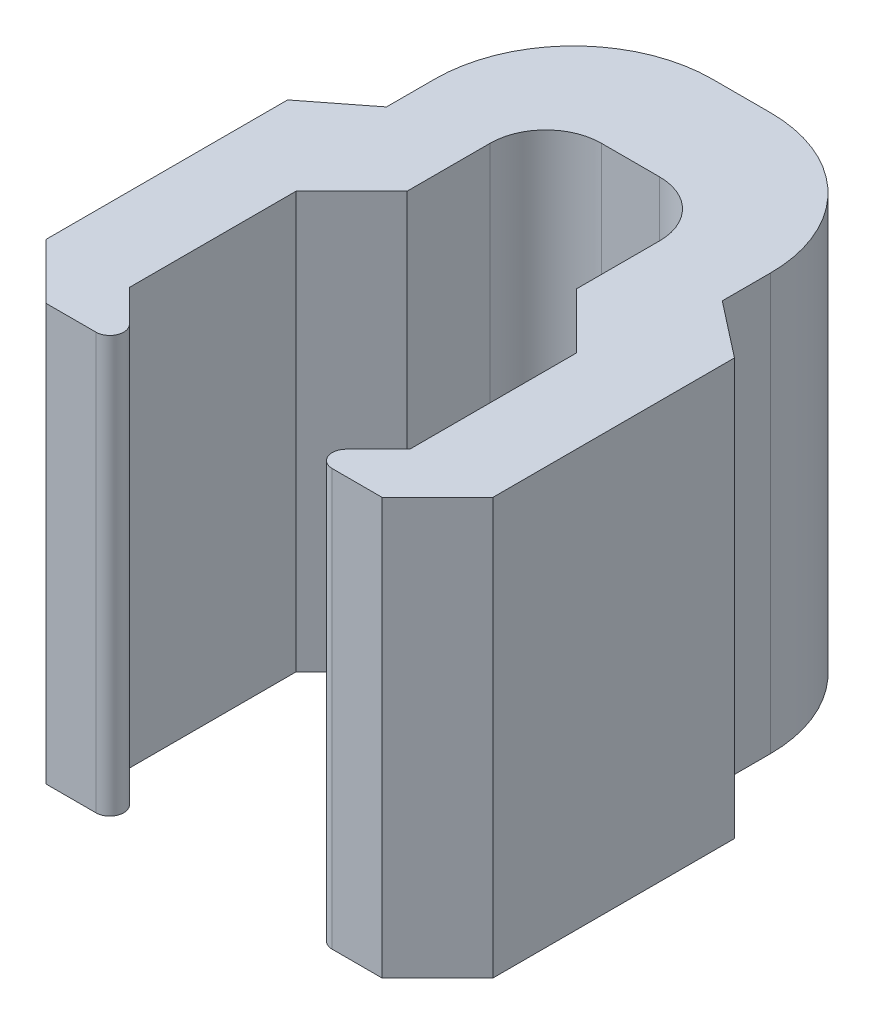
ISO-10303-21;
HEADER;
FILE_DESCRIPTION(('STEP AP214'),'2;1');
FILE_NAME('part.step','',(''),(''),'','','');
FILE_SCHEMA(('AUTOMOTIVE_DESIGN { 1 0 10303 214 1 1 1 1 }'));
ENDSEC;
DATA;
#1=APPLICATION_CONTEXT('core data for automotive mechanical design processes');
#2=APPLICATION_PROTOCOL_DEFINITION('international standard','automotive_design',2000,#1);
#3=PRODUCT_CONTEXT('',#1,'mechanical');
#4=PRODUCT('Part','Part','',(#3));
#5=PRODUCT_RELATED_PRODUCT_CATEGORY('part','',(#4));
#6=PRODUCT_DEFINITION_FORMATION('','',#4);
#7=PRODUCT_DEFINITION_CONTEXT('part definition',#1,'design');
#8=PRODUCT_DEFINITION('design','',#6,#7);
#9=PRODUCT_DEFINITION_SHAPE('','',#8);
#10=(LENGTH_UNIT() NAMED_UNIT(*) SI_UNIT(.MILLI.,.METRE.));
#11=(NAMED_UNIT(*) PLANE_ANGLE_UNIT() SI_UNIT($,.RADIAN.));
#12=(NAMED_UNIT(*) SI_UNIT($,.STERADIAN.) SOLID_ANGLE_UNIT());
#13=UNCERTAINTY_MEASURE_WITH_UNIT(LENGTH_MEASURE(1.E-05),#10,'distance_accuracy_value','');
#14=(GEOMETRIC_REPRESENTATION_CONTEXT(3) GLOBAL_UNCERTAINTY_ASSIGNED_CONTEXT((#13)) GLOBAL_UNIT_ASSIGNED_CONTEXT((#10,
#11,#12)) REPRESENTATION_CONTEXT('',''));
#15=CARTESIAN_POINT('',(0.,0.,0.));
#16=DIRECTION('',(0.,0.,1.));
#17=DIRECTION('',(1.,0.,0.));
#18=AXIS2_PLACEMENT_3D('',#15,#16,#17);
#19=CARTESIAN_POINT('',(-11.1661026887094,15.,0.));
#20=DIRECTION('',(1.,0.,0.));
#21=DIRECTION('',(0.,0.,-1.));
#22=AXIS2_PLACEMENT_3D('',#19,#20,#21);
#23=PLANE('',#22);
#24=DIRECTION('',(0.,0.,1.));
#25=VECTOR('',#24,1.);
#26=CARTESIAN_POINT('',(-11.1661026887094,0.,0.));
#27=LINE('',#26,#25);
#28=CARTESIAN_POINT('',(-11.1661026887094,0.,-7.37104122945223));
#29=VERTEX_POINT('',#28);
#30=CARTESIAN_POINT('',(-11.1661026887094,0.,-1.37104122945223));
#31=VERTEX_POINT('',#30);
#32=EDGE_CURVE('E212',#29,#31,#27,.T.);
#33=ORIENTED_EDGE('',*,*,#32,.F.);
#34=DIRECTION('',(0.,-1.,0.));
#35=VECTOR('',#34,1.);
#36=CARTESIAN_POINT('',(-11.1661026887094,15.,-7.37104122945223));
#37=LINE('',#36,#35);
#38=CARTESIAN_POINT('',(-11.1661026887094,15.,-7.37104122945223));
#39=VERTEX_POINT('',#38);
#40=EDGE_CURVE('E207',#39,#29,#37,.T.);
#41=ORIENTED_EDGE('',*,*,#40,.F.);
#42=DIRECTION('',(0.,0.,1.));
#43=VECTOR('',#42,1.);
#44=CARTESIAN_POINT('',(-11.1661026887094,15.,0.));
#45=LINE('',#44,#43);
#46=CARTESIAN_POINT('',(-11.1661026887094,15.,-1.37104122945223));
#47=VERTEX_POINT('',#46);
#48=EDGE_CURVE('E210',#39,#47,#45,.T.);
#49=ORIENTED_EDGE('',*,*,#48,.T.);
#50=DIRECTION('',(0.,-1.,0.));
#51=VECTOR('',#50,1.);
#52=CARTESIAN_POINT('',(-11.1661026887094,15.,-1.37104122945223));
#53=LINE('',#52,#51);
#54=EDGE_CURVE('E273',#47,#31,#53,.T.);
#55=ORIENTED_EDGE('',*,*,#54,.T.);
#56=EDGE_LOOP('',(#33,#41,#49,#55));
#57=FACE_BOUND('',#56,.T.);
#58=ADVANCED_FACE('F34',(#57),#23,.T.);
#59=CARTESIAN_POINT('',(-9.26857195908083,15.,-9.26857195908083));
#60=DIRECTION('',(-0.707106781186547,0.,-0.707106781186548));
#61=DIRECTION('',(-0.707106781186548,0.,0.707106781186547));
#62=AXIS2_PLACEMENT_3D('',#59,#60,#61);
#63=PLANE('',#62);
#64=DIRECTION('',(0.707106781186548,0.,-0.707106781186547));
#65=VECTOR('',#64,1.);
#66=CARTESIAN_POINT('',(-9.26857195908083,0.,-9.26857195908083));
#67=LINE('',#66,#65);
#68=CARTESIAN_POINT('',(-9.16610268870943,0.,-9.37104122945222));
#69=VERTEX_POINT('',#68);
#70=EDGE_CURVE('E275',#29,#69,#67,.T.);
#71=ORIENTED_EDGE('',*,*,#70,.T.);
#72=DIRECTION('',(0.,-1.,0.));
#73=VECTOR('',#72,1.);
#74=CARTESIAN_POINT('',(-9.16610268870943,15.,-9.37104122945222));
#75=LINE('',#74,#73);
#76=CARTESIAN_POINT('',(-9.16610268870943,15.,-9.37104122945222));
#77=VERTEX_POINT('',#76);
#78=EDGE_CURVE('E216',#77,#69,#75,.T.);
#79=ORIENTED_EDGE('',*,*,#78,.F.);
#80=DIRECTION('',(0.707106781186548,0.,-0.707106781186547));
#81=VECTOR('',#80,1.);
#82=CARTESIAN_POINT('',(-9.26857195908083,15.,-9.26857195908083));
#83=LINE('',#82,#81);
#84=EDGE_CURVE('E219',#39,#77,#83,.T.);
#85=ORIENTED_EDGE('',*,*,#84,.F.);
#86=ORIENTED_EDGE('',*,*,#40,.T.);
#87=EDGE_LOOP('',(#71,#79,#85,#86));
#88=FACE_BOUND('',#87,.T.);
#89=ADVANCED_FACE('F220',(#88),#63,.F.);
#90=CARTESIAN_POINT('',(-9.16610268870943,15.,0.));
#91=DIRECTION('',(-1.,0.,0.));
#92=DIRECTION('',(0.,0.,1.));
#93=AXIS2_PLACEMENT_3D('',#90,#91,#92);
#94=PLANE('',#93);
#95=DIRECTION('',(0.,0.,-1.));
#96=VECTOR('',#95,1.);
#97=CARTESIAN_POINT('',(-9.16610268870943,0.,0.));
#98=LINE('',#97,#96);
#99=CARTESIAN_POINT('',(-9.16610268870943,0.,-12.3710412294522));
#100=VERTEX_POINT('',#99);
#101=EDGE_CURVE('E277',#69,#100,#98,.T.);
#102=ORIENTED_EDGE('',*,*,#101,.T.);
#103=DIRECTION('',(0.,-1.,0.));
#104=VECTOR('',#103,1.);
#105=CARTESIAN_POINT('',(-9.16610268870943,15.,-12.3710412294522));
#106=LINE('',#105,#104);
#107=CARTESIAN_POINT('',(-9.16610268870943,15.,-12.3710412294522));
#108=VERTEX_POINT('',#107);
#109=EDGE_CURVE('E362',#100,#108,#106,.F.);
#110=ORIENTED_EDGE('',*,*,#109,.T.);
#111=DIRECTION('',(0.,0.,-1.));
#112=VECTOR('',#111,1.);
#113=CARTESIAN_POINT('',(-9.16610268870943,15.,0.));
#114=LINE('',#113,#112);
#115=EDGE_CURVE('E224',#77,#108,#114,.T.);
#116=ORIENTED_EDGE('',*,*,#115,.F.);
#117=ORIENTED_EDGE('',*,*,#78,.T.);
#118=EDGE_LOOP('',(#102,#110,#116,#117));
#119=FACE_BOUND('',#118,.T.);
#120=ADVANCED_FACE('F411',(#119),#94,.F.);
#121=CARTESIAN_POINT('',(0.,15.,-14.3710412294522));
#122=DIRECTION('',(0.,0.,-1.));
#123=DIRECTION('',(-1.,0.,0.));
#124=AXIS2_PLACEMENT_3D('',#121,#122,#123);
#125=PLANE('',#124);
#126=DIRECTION('',(1.,0.,0.));
#127=VECTOR('',#126,1.);
#128=CARTESIAN_POINT('',(0.,0.,-14.3710412294522));
#129=LINE('',#128,#127);
#130=CARTESIAN_POINT('',(-7.16610268870943,0.,-14.3710412294522));
#131=VERTEX_POINT('',#130);
#132=CARTESIAN_POINT('',(-5.06610268870944,0.,-14.3710412294522));
#133=VERTEX_POINT('',#132);
#134=EDGE_CURVE('E280',#131,#133,#129,.T.);
#135=ORIENTED_EDGE('',*,*,#134,.T.);
#136=DIRECTION('',(0.,-1.,0.));
#137=VECTOR('',#136,1.);
#138=CARTESIAN_POINT('',(-5.06610268870944,15.,-14.3710412294522));
#139=LINE('',#138,#137);
#140=CARTESIAN_POINT('',(-5.06610268870944,15.,-14.3710412294522));
#141=VERTEX_POINT('',#140);
#142=EDGE_CURVE('E360',#133,#141,#139,.F.);
#143=ORIENTED_EDGE('',*,*,#142,.T.);
#144=DIRECTION('',(1.,0.,0.));
#145=VECTOR('',#144,1.);
#146=CARTESIAN_POINT('',(0.,15.,-14.3710412294522));
#147=LINE('',#146,#145);
#148=CARTESIAN_POINT('',(-7.16610268870943,15.,-14.3710412294522));
#149=VERTEX_POINT('',#148);
#150=EDGE_CURVE('E236',#149,#141,#147,.T.);
#151=ORIENTED_EDGE('',*,*,#150,.F.);
#152=DIRECTION('',(0.,-1.,0.));
#153=VECTOR('',#152,1.);
#154=CARTESIAN_POINT('',(-7.16610268870943,0.,-14.3710412294522));
#155=LINE('',#154,#153);
#156=EDGE_CURVE('E357',#149,#131,#155,.T.);
#157=ORIENTED_EDGE('',*,*,#156,.T.);
#158=EDGE_LOOP('',(#135,#143,#151,#157));
#159=FACE_BOUND('',#158,.T.);
#160=ADVANCED_FACE('F420',(#159),#125,.F.);
#161=CARTESIAN_POINT('',(-3.06610268870944,15.,0.));
#162=DIRECTION('',(-1.,0.,0.));
#163=DIRECTION('',(0.,0.,1.));
#164=AXIS2_PLACEMENT_3D('',#161,#162,#163);
#165=PLANE('',#164);
#166=DIRECTION('',(0.,0.,-1.));
#167=VECTOR('',#166,1.);
#168=CARTESIAN_POINT('',(-3.06610268870944,15.,0.));
#169=LINE('',#168,#167);
#170=CARTESIAN_POINT('',(-3.06610268870944,15.,-9.37104122945222));
#171=VERTEX_POINT('',#170);
#172=CARTESIAN_POINT('',(-3.06610268870944,15.,-12.3710412294522));
#173=VERTEX_POINT('',#172);
#174=EDGE_CURVE('E239',#171,#173,#169,.T.);
#175=ORIENTED_EDGE('',*,*,#174,.T.);
#176=DIRECTION('',(0.,-1.,0.));
#177=VECTOR('',#176,1.);
#178=CARTESIAN_POINT('',(-3.06610268870944,15.,-12.3710412294522));
#179=LINE('',#178,#177);
#180=CARTESIAN_POINT('',(-3.06610268870944,0.,-12.3710412294522));
#181=VERTEX_POINT('',#180);
#182=EDGE_CURVE('E354',#173,#181,#179,.T.);
#183=ORIENTED_EDGE('',*,*,#182,.T.);
#184=DIRECTION('',(0.,0.,-1.));
#185=VECTOR('',#184,1.);
#186=CARTESIAN_POINT('',(-3.06610268870944,0.,0.));
#187=LINE('',#186,#185);
#188=CARTESIAN_POINT('',(-3.06610268870944,0.,-9.37104122945222));
#189=VERTEX_POINT('',#188);
#190=EDGE_CURVE('E283',#189,#181,#187,.T.);
#191=ORIENTED_EDGE('',*,*,#190,.F.);
#192=DIRECTION('',(0.,-1.,0.));
#193=VECTOR('',#192,1.);
#194=CARTESIAN_POINT('',(-3.06610268870944,15.,-9.37104122945222));
#195=LINE('',#194,#193);
#196=EDGE_CURVE('E333',#171,#189,#195,.T.);
#197=ORIENTED_EDGE('',*,*,#196,.F.);
#198=EDGE_LOOP('',(#175,#183,#191,#197));
#199=FACE_BOUND('',#198,.T.);
#200=ADVANCED_FACE('F429',(#199),#165,.T.);
#201=CARTESIAN_POINT('',(3.15246927037139,15.,-3.15246927037139));
#202=DIRECTION('',(0.707106781186547,0.,-0.707106781186547));
#203=DIRECTION('',(-0.707106781186548,0.,-0.707106781186548));
#204=AXIS2_PLACEMENT_3D('',#201,#202,#203);
#205=PLANE('',#204);
#206=DIRECTION('',(0.707106781186548,0.,0.707106781186548));
#207=VECTOR('',#206,1.);
#208=CARTESIAN_POINT('',(3.15246927037139,0.,-3.15246927037139));
#209=LINE('',#208,#207);
#210=CARTESIAN_POINT('',(-1.06610268870944,0.,-7.37104122945222));
#211=VERTEX_POINT('',#210);
#212=EDGE_CURVE('E286',#189,#211,#209,.T.);
#213=ORIENTED_EDGE('',*,*,#212,.T.);
#214=DIRECTION('',(0.,-1.,0.));
#215=VECTOR('',#214,1.);
#216=CARTESIAN_POINT('',(-1.06610268870944,15.,-7.37104122945222));
#217=LINE('',#216,#215);
#218=CARTESIAN_POINT('',(-1.06610268870944,15.,-7.37104122945222));
#219=VERTEX_POINT('',#218);
#220=EDGE_CURVE('E330',#219,#211,#217,.T.);
#221=ORIENTED_EDGE('',*,*,#220,.F.);
#222=DIRECTION('',(0.707106781186548,0.,0.707106781186548));
#223=VECTOR('',#222,1.);
#224=CARTESIAN_POINT('',(3.15246927037139,15.,-3.15246927037139));
#225=LINE('',#224,#223);
#226=EDGE_CURVE('E242',#171,#219,#225,.T.);
#227=ORIENTED_EDGE('',*,*,#226,.F.);
#228=ORIENTED_EDGE('',*,*,#196,.T.);
#229=EDGE_LOOP('',(#213,#221,#227,#228));
#230=FACE_BOUND('',#229,.T.);
#231=ADVANCED_FACE('F436',(#230),#205,.F.);
#232=CARTESIAN_POINT('',(-1.06610268870944,15.,0.));
#233=DIRECTION('',(1.,0.,0.));
#234=DIRECTION('',(0.,0.,-1.));
#235=AXIS2_PLACEMENT_3D('',#232,#233,#234);
#236=PLANE('',#235);
#237=DIRECTION('',(0.,0.,1.));
#238=VECTOR('',#237,1.);
#239=CARTESIAN_POINT('',(-1.06610268870944,0.,0.));
#240=LINE('',#239,#238);
#241=CARTESIAN_POINT('',(-1.06610268870944,0.,-1.37104122945222));
#242=VERTEX_POINT('',#241);
#243=EDGE_CURVE('E288',#211,#242,#240,.T.);
#244=ORIENTED_EDGE('',*,*,#243,.T.);
#245=DIRECTION('',(0.,-1.,0.));
#246=VECTOR('',#245,1.);
#247=CARTESIAN_POINT('',(-1.06610268870944,15.,-1.37104122945222));
#248=LINE('',#247,#246);
#249=CARTESIAN_POINT('',(-1.06610268870944,15.,-1.37104122945222));
#250=VERTEX_POINT('',#249);
#251=EDGE_CURVE('E327',#250,#242,#248,.T.);
#252=ORIENTED_EDGE('',*,*,#251,.F.);
#253=DIRECTION('',(0.,0.,1.));
#254=VECTOR('',#253,1.);
#255=CARTESIAN_POINT('',(-1.06610268870944,15.,0.));
#256=LINE('',#255,#254);
#257=EDGE_CURVE('E244',#219,#250,#256,.T.);
#258=ORIENTED_EDGE('',*,*,#257,.F.);
#259=ORIENTED_EDGE('',*,*,#220,.T.);
#260=EDGE_LOOP('',(#244,#252,#258,#259));
#261=FACE_BOUND('',#260,.T.);
#262=ADVANCED_FACE('F439',(#261),#236,.F.);
#263=CARTESIAN_POINT('',(-1.21857195908083,15.,-1.21857195908083));
#264=DIRECTION('',(0.707106781186547,0.,0.707106781186547));
#265=DIRECTION('',(0.707106781186548,0.,-0.707106781186548));
#266=AXIS2_PLACEMENT_3D('',#263,#264,#265);
#267=PLANE('',#266);
#268=DIRECTION('',(-0.707106781186548,0.,0.707106781186548));
#269=VECTOR('',#268,1.);
#270=CARTESIAN_POINT('',(-1.21857195908083,0.,-1.21857195908083));
#271=LINE('',#270,#269);
#272=CARTESIAN_POINT('',(-2.21254929811616,0.,-0.224594620045497));
#273=VERTEX_POINT('',#272);
#274=EDGE_CURVE('E290',#242,#273,#271,.T.);
#275=ORIENTED_EDGE('',*,*,#274,.T.);
#276=DIRECTION('',(0.,-1.,0.));
#277=VECTOR('',#276,1.);
#278=CARTESIAN_POINT('',(-2.21254929811616,15.,-0.224594620045498));
#279=LINE('',#278,#277);
#280=CARTESIAN_POINT('',(-2.21254929811616,15.,-0.224594620045497));
#281=VERTEX_POINT('',#280);
#282=EDGE_CURVE('E397',#273,#281,#279,.F.);
#283=ORIENTED_EDGE('',*,*,#282,.T.);
#284=DIRECTION('',(-0.707106781186548,0.,0.707106781186548));
#285=VECTOR('',#284,1.);
#286=CARTESIAN_POINT('',(-1.21857195908083,15.,-1.21857195908083));
#287=LINE('',#286,#285);
#288=EDGE_CURVE('E246',#250,#281,#287,.T.);
#289=ORIENTED_EDGE('',*,*,#288,.F.);
#290=ORIENTED_EDGE('',*,*,#251,.T.);
#291=EDGE_LOOP('',(#275,#283,#289,#290));
#292=FACE_BOUND('',#291,.T.);
#293=ADVANCED_FACE('F443',(#292),#267,.F.);
#294=CARTESIAN_POINT('',(0.,15.,0.628958770547775));
#295=DIRECTION('',(0.,0.,1.));
#296=DIRECTION('',(1.,0.,0.));
#297=AXIS2_PLACEMENT_3D('',#294,#295,#296);
#298=PLANE('',#297);
#299=DIRECTION('',(-1.,0.,0.));
#300=VECTOR('',#299,1.);
#301=CARTESIAN_POINT('',(0.,15.,0.628958770547775));
#302=LINE('',#301,#300);
#303=CARTESIAN_POINT('',(-0.0661026887094369,15.,0.628958770547775));
#304=VERTEX_POINT('',#303);
#305=CARTESIAN_POINT('',(-1.85899590752289,15.,0.628958770547776));
#306=VERTEX_POINT('',#305);
#307=EDGE_CURVE('E248',#304,#306,#302,.T.);
#308=ORIENTED_EDGE('',*,*,#307,.T.);
#309=DIRECTION('',(0.,-1.,0.));
#310=VECTOR('',#309,1.);
#311=CARTESIAN_POINT('',(-1.85899590752289,0.,0.628958770547776));
#312=LINE('',#311,#310);
#313=CARTESIAN_POINT('',(-1.85899590752289,0.,0.628958770547776));
#314=VERTEX_POINT('',#313);
#315=EDGE_CURVE('E390',#306,#314,#312,.T.);
#316=ORIENTED_EDGE('',*,*,#315,.T.);
#317=DIRECTION('',(-1.,0.,0.));
#318=VECTOR('',#317,1.);
#319=CARTESIAN_POINT('',(0.,0.,0.628958770547775));
#320=LINE('',#319,#318);
#321=CARTESIAN_POINT('',(-0.0661026887094369,0.,0.628958770547775));
#322=VERTEX_POINT('',#321);
#323=EDGE_CURVE('E293',#322,#314,#320,.T.);
#324=ORIENTED_EDGE('',*,*,#323,.F.);
#325=DIRECTION('',(0.,1.,0.));
#326=VECTOR('',#325,1.);
#327=CARTESIAN_POINT('',(-0.0661026887094369,15.,0.628958770547775));
#328=LINE('',#327,#326);
#329=EDGE_CURVE('E352',#322,#304,#328,.T.);
#330=ORIENTED_EDGE('',*,*,#329,.T.);
#331=EDGE_LOOP('',(#308,#316,#324,#330));
#332=FACE_BOUND('',#331,.T.);
#333=ADVANCED_FACE('F452',(#332),#298,.T.);
#334=CARTESIAN_POINT('',(1.93389731129057,15.,0.));
#335=DIRECTION('',(1.,0.,0.));
#336=DIRECTION('',(0.,0.,-1.));
#337=AXIS2_PLACEMENT_3D('',#334,#335,#336);
#338=PLANE('',#337);
#339=DIRECTION('',(0.,0.,1.));
#340=VECTOR('',#339,1.);
#341=CARTESIAN_POINT('',(1.93389731129057,15.,0.));
#342=LINE('',#341,#340);
#343=CARTESIAN_POINT('',(1.93389731129057,15.,-10.0710412294522));
#344=VERTEX_POINT('',#343);
#345=CARTESIAN_POINT('',(1.93389731129057,15.,-1.37104122945222));
#346=VERTEX_POINT('',#345);
#347=EDGE_CURVE('E251',#344,#346,#342,.T.);
#348=ORIENTED_EDGE('',*,*,#347,.T.);
#349=DIRECTION('',(0.,-1.,0.));
#350=VECTOR('',#349,1.);
#351=CARTESIAN_POINT('',(1.93389731129057,15.,-1.37104122945222));
#352=LINE('',#351,#350);
#353=CARTESIAN_POINT('',(1.93389731129057,0.,-1.37104122945222));
#354=VERTEX_POINT('',#353);
#355=EDGE_CURVE('E349',#346,#354,#352,.T.);
#356=ORIENTED_EDGE('',*,*,#355,.T.);
#357=DIRECTION('',(0.,0.,1.));
#358=VECTOR('',#357,1.);
#359=CARTESIAN_POINT('',(1.93389731129057,0.,0.));
#360=LINE('',#359,#358);
#361=CARTESIAN_POINT('',(1.93389731129057,0.,-10.0710412294522));
#362=VERTEX_POINT('',#361);
#363=EDGE_CURVE('E296',#362,#354,#360,.T.);
#364=ORIENTED_EDGE('',*,*,#363,.F.);
#365=DIRECTION('',(0.,-1.,0.));
#366=VECTOR('',#365,1.);
#367=CARTESIAN_POINT('',(1.93389731129057,15.,-10.0710412294522));
#368=LINE('',#367,#366);
#369=EDGE_CURVE('E325',#344,#362,#368,.T.);
#370=ORIENTED_EDGE('',*,*,#369,.F.);
#371=EDGE_LOOP('',(#348,#356,#364,#370));
#372=FACE_BOUND('',#371,.T.);
#373=ADVANCED_FACE('F461',(#372),#338,.T.);
#374=CARTESIAN_POINT('',(5.61603799562964,15.,-7.19825635282026));
#375=DIRECTION('',(-0.615126999355723,0.,0.788428040257083));
#376=DIRECTION('',(0.788428040257083,0.,0.615126999355723));
#377=AXIS2_PLACEMENT_3D('',#374,#375,#376);
#378=PLANE('',#377);
#379=DIRECTION('',(-0.788428040257083,0.,-0.615126999355723));
#380=VECTOR('',#379,1.);
#381=CARTESIAN_POINT('',(5.61603799562964,0.,-7.19825635282026));
#382=LINE('',#381,#380);
#383=CARTESIAN_POINT('',(-0.066102688709436,0.,-11.6314296680855));
#384=VERTEX_POINT('',#383);
#385=EDGE_CURVE('E299',#362,#384,#382,.T.);
#386=ORIENTED_EDGE('',*,*,#385,.T.);
#387=DIRECTION('',(0.,-1.,0.));
#388=VECTOR('',#387,1.);
#389=CARTESIAN_POINT('',(-0.066102688709436,15.,-11.6314296680855));
#390=LINE('',#389,#388);
#391=CARTESIAN_POINT('',(-0.066102688709436,15.,-11.6314296680855));
#392=VERTEX_POINT('',#391);
#393=EDGE_CURVE('E322',#392,#384,#390,.T.);
#394=ORIENTED_EDGE('',*,*,#393,.F.);
#395=DIRECTION('',(-0.788428040257083,0.,-0.615126999355723));
#396=VECTOR('',#395,1.);
#397=CARTESIAN_POINT('',(5.61603799562964,15.,-7.19825635282026));
#398=LINE('',#397,#396);
#399=EDGE_CURVE('E254',#344,#392,#398,.T.);
#400=ORIENTED_EDGE('',*,*,#399,.F.);
#401=ORIENTED_EDGE('',*,*,#369,.T.);
#402=EDGE_LOOP('',(#386,#394,#400,#401));
#403=FACE_BOUND('',#402,.T.);
#404=ADVANCED_FACE('F468',(#403),#378,.F.);
#405=CARTESIAN_POINT('',(-0.066102688709436,15.,0.));
#406=DIRECTION('',(-1.,0.,0.));
#407=DIRECTION('',(0.,0.,1.));
#408=AXIS2_PLACEMENT_3D('',#405,#406,#407);
#409=PLANE('',#408);
#410=DIRECTION('',(0.,0.,-1.));
#411=VECTOR('',#410,1.);
#412=CARTESIAN_POINT('',(-0.066102688709436,0.,0.));
#413=LINE('',#412,#411);
#414=CARTESIAN_POINT('',(-0.066102688709436,0.,-13.3710412294522));
#415=VERTEX_POINT('',#414);
#416=EDGE_CURVE('E301',#384,#415,#413,.T.);
#417=ORIENTED_EDGE('',*,*,#416,.T.);
#418=DIRECTION('',(0.,-1.,0.));
#419=VECTOR('',#418,1.);
#420=CARTESIAN_POINT('',(-0.066102688709436,15.,-13.3710412294522));
#421=LINE('',#420,#419);
#422=CARTESIAN_POINT('',(-0.066102688709436,15.,-13.3710412294522));
#423=VERTEX_POINT('',#422);
#424=EDGE_CURVE('E381',#415,#423,#421,.F.);
#425=ORIENTED_EDGE('',*,*,#424,.T.);
#426=DIRECTION('',(0.,0.,-1.));
#427=VECTOR('',#426,1.);
#428=CARTESIAN_POINT('',(-0.066102688709436,15.,0.));
#429=LINE('',#428,#427);
#430=EDGE_CURVE('E256',#392,#423,#429,.T.);
#431=ORIENTED_EDGE('',*,*,#430,.F.);
#432=ORIENTED_EDGE('',*,*,#393,.T.);
#433=EDGE_LOOP('',(#417,#425,#431,#432));
#434=FACE_BOUND('',#433,.T.);
#435=ADVANCED_FACE('F471',(#434),#409,.F.);
#436=CARTESIAN_POINT('',(0.,15.,-18.3710412294522));
#437=DIRECTION('',(0.,0.,-1.));
#438=DIRECTION('',(-1.,0.,0.));
#439=AXIS2_PLACEMENT_3D('',#436,#437,#438);
#440=PLANE('',#439);
#441=DIRECTION('',(1.,0.,0.));
#442=VECTOR('',#441,1.);
#443=CARTESIAN_POINT('',(0.,15.,-18.3710412294522));
#444=LINE('',#443,#442);
#445=CARTESIAN_POINT('',(-7.16610268870944,15.,-18.3710412294522));
#446=VERTEX_POINT('',#445);
#447=CARTESIAN_POINT('',(-5.06610268870944,15.,-18.3710412294522));
#448=VERTEX_POINT('',#447);
#449=EDGE_CURVE('E259',#446,#448,#444,.T.);
#450=ORIENTED_EDGE('',*,*,#449,.T.);
#451=DIRECTION('',(0.,-1.,0.));
#452=VECTOR('',#451,1.);
#453=CARTESIAN_POINT('',(-5.06610268870944,0.,-18.3710412294522));
#454=LINE('',#453,#452);
#455=CARTESIAN_POINT('',(-5.06610268870944,0.,-18.3710412294522));
#456=VERTEX_POINT('',#455);
#457=EDGE_CURVE('E374',#448,#456,#454,.T.);
#458=ORIENTED_EDGE('',*,*,#457,.T.);
#459=DIRECTION('',(1.,0.,0.));
#460=VECTOR('',#459,1.);
#461=CARTESIAN_POINT('',(0.,0.,-18.3710412294522));
#462=LINE('',#461,#460);
#463=CARTESIAN_POINT('',(-7.16610268870944,0.,-18.3710412294522));
#464=VERTEX_POINT('',#463);
#465=EDGE_CURVE('E304',#464,#456,#462,.T.);
#466=ORIENTED_EDGE('',*,*,#465,.F.);
#467=DIRECTION('',(0.,-1.,0.));
#468=VECTOR('',#467,1.);
#469=CARTESIAN_POINT('',(-7.16610268870944,15.,-18.3710412294522));
#470=LINE('',#469,#468);
#471=EDGE_CURVE('E372',#464,#446,#470,.F.);
#472=ORIENTED_EDGE('',*,*,#471,.T.);
#473=EDGE_LOOP('',(#450,#458,#466,#472));
#474=FACE_BOUND('',#473,.T.);
#475=ADVANCED_FACE('F479',(#474),#440,.T.);
#476=CARTESIAN_POINT('',(-12.1661026887094,15.,0.));
#477=DIRECTION('',(-1.,0.,0.));
#478=DIRECTION('',(0.,0.,1.));
#479=AXIS2_PLACEMENT_3D('',#476,#477,#478);
#480=PLANE('',#479);
#481=DIRECTION('',(0.,0.,-1.));
#482=VECTOR('',#481,1.);
#483=CARTESIAN_POINT('',(-12.1661026887094,15.,0.));
#484=LINE('',#483,#482);
#485=CARTESIAN_POINT('',(-12.1661026887094,15.,-11.6314296680855));
#486=VERTEX_POINT('',#485);
#487=CARTESIAN_POINT('',(-12.1661026887094,15.,-13.3710412294522));
#488=VERTEX_POINT('',#487);
#489=EDGE_CURVE('E262',#486,#488,#484,.T.);
#490=ORIENTED_EDGE('',*,*,#489,.T.);
#491=DIRECTION('',(0.,-1.,0.));
#492=VECTOR('',#491,1.);
#493=CARTESIAN_POINT('',(-12.1661026887094,15.,-13.3710412294522));
#494=LINE('',#493,#492);
#495=CARTESIAN_POINT('',(-12.1661026887094,0.,-13.3710412294522));
#496=VERTEX_POINT('',#495);
#497=EDGE_CURVE('E387',#488,#496,#494,.T.);
#498=ORIENTED_EDGE('',*,*,#497,.T.);
#499=DIRECTION('',(0.,0.,-1.));
#500=VECTOR('',#499,1.);
#501=CARTESIAN_POINT('',(-12.1661026887094,0.,0.));
#502=LINE('',#501,#500);
#503=CARTESIAN_POINT('',(-12.1661026887094,0.,-11.6314296680855));
#504=VERTEX_POINT('',#503);
#505=EDGE_CURVE('E307',#504,#496,#502,.T.);
#506=ORIENTED_EDGE('',*,*,#505,.F.);
#507=DIRECTION('',(0.,-1.,0.));
#508=VECTOR('',#507,1.);
#509=CARTESIAN_POINT('',(-12.1661026887094,15.,-11.6314296680855));
#510=LINE('',#509,#508);
#511=EDGE_CURVE('E320',#486,#504,#510,.T.);
#512=ORIENTED_EDGE('',*,*,#511,.F.);
#513=EDGE_LOOP('',(#490,#498,#506,#512));
#514=FACE_BOUND('',#513,.T.);
#515=ADVANCED_FACE('F488',(#514),#480,.T.);
#516=CARTESIAN_POINT('',(-10.2444748549036,15.,-13.1306725956988));
#517=DIRECTION('',(-0.615126999355723,0.,-0.788428040257083));
#518=DIRECTION('',(-0.788428040257083,0.,0.615126999355723));
#519=AXIS2_PLACEMENT_3D('',#516,#517,#518);
#520=PLANE('',#519);
#521=DIRECTION('',(0.788428040257083,0.,-0.615126999355723));
#522=VECTOR('',#521,1.);
#523=CARTESIAN_POINT('',(-10.2444748549036,0.,-13.1306725956988));
#524=LINE('',#523,#522);
#525=CARTESIAN_POINT('',(-14.1661026887094,0.,-10.0710412294522));
#526=VERTEX_POINT('',#525);
#527=EDGE_CURVE('E310',#526,#504,#524,.T.);
#528=ORIENTED_EDGE('',*,*,#527,.F.);
#529=DIRECTION('',(0.,-1.,0.));
#530=VECTOR('',#529,1.);
#531=CARTESIAN_POINT('',(-14.1661026887094,15.,-10.0710412294522));
#532=LINE('',#531,#530);
#533=CARTESIAN_POINT('',(-14.1661026887094,15.,-10.0710412294522));
#534=VERTEX_POINT('',#533);
#535=EDGE_CURVE('E317',#534,#526,#532,.T.);
#536=ORIENTED_EDGE('',*,*,#535,.F.);
#537=DIRECTION('',(0.788428040257083,0.,-0.615126999355723));
#538=VECTOR('',#537,1.);
#539=CARTESIAN_POINT('',(-10.2444748549036,15.,-13.1306725956988));
#540=LINE('',#539,#538);
#541=EDGE_CURVE('E265',#534,#486,#540,.T.);
#542=ORIENTED_EDGE('',*,*,#541,.T.);
#543=ORIENTED_EDGE('',*,*,#511,.T.);
#544=EDGE_LOOP('',(#528,#536,#542,#543));
#545=FACE_BOUND('',#544,.T.);
#546=ADVANCED_FACE('F492',(#545),#520,.T.);
#547=CARTESIAN_POINT('',(-14.1661026887094,15.,0.));
#548=DIRECTION('',(-1.,0.,0.));
#549=DIRECTION('',(0.,0.,1.));
#550=AXIS2_PLACEMENT_3D('',#547,#548,#549);
#551=PLANE('',#550);
#552=DIRECTION('',(0.,0.,-1.));
#553=VECTOR('',#552,1.);
#554=CARTESIAN_POINT('',(-14.1661026887094,0.,0.));
#555=LINE('',#554,#553);
#556=CARTESIAN_POINT('',(-14.1661026887094,0.,-1.37104122945223));
#557=VERTEX_POINT('',#556);
#558=EDGE_CURVE('E313',#557,#526,#555,.T.);
#559=ORIENTED_EDGE('',*,*,#558,.F.);
#560=DIRECTION('',(0.,1.,0.));
#561=VECTOR('',#560,1.);
#562=CARTESIAN_POINT('',(-14.1661026887094,15.,-1.37104122945223));
#563=LINE('',#562,#561);
#564=CARTESIAN_POINT('',(-14.1661026887094,15.,-1.37104122945223));
#565=VERTEX_POINT('',#564);
#566=EDGE_CURVE('E342',#557,#565,#563,.T.);
#567=ORIENTED_EDGE('',*,*,#566,.T.);
#568=DIRECTION('',(0.,0.,-1.));
#569=VECTOR('',#568,1.);
#570=CARTESIAN_POINT('',(-14.1661026887094,15.,0.));
#571=LINE('',#570,#569);
#572=EDGE_CURVE('E268',#565,#534,#571,.T.);
#573=ORIENTED_EDGE('',*,*,#572,.T.);
#574=ORIENTED_EDGE('',*,*,#535,.T.);
#575=EDGE_LOOP('',(#559,#567,#573,#574));
#576=FACE_BOUND('',#575,.T.);
#577=ADVANCED_FACE('F577',(#576),#551,.T.);
#578=CARTESIAN_POINT('',(0.,15.,0.628958770547773));
#579=DIRECTION('',(0.,0.,1.));
#580=DIRECTION('',(1.,0.,0.));
#581=AXIS2_PLACEMENT_3D('',#578,#579,#580);
#582=PLANE('',#581);
#583=DIRECTION('',(-1.,0.,0.));
#584=VECTOR('',#583,1.);
#585=CARTESIAN_POINT('',(0.,0.,0.628958770547773));
#586=LINE('',#585,#584);
#587=CARTESIAN_POINT('',(-10.373209469896,0.,0.628958770547776));
#588=VERTEX_POINT('',#587);
#589=CARTESIAN_POINT('',(-12.1661026887094,0.,0.628958770547777));
#590=VERTEX_POINT('',#589);
#591=EDGE_CURVE('E232',#588,#590,#586,.T.);
#592=ORIENTED_EDGE('',*,*,#591,.F.);
#593=DIRECTION('',(0.,-1.,0.));
#594=VECTOR('',#593,1.);
#595=CARTESIAN_POINT('',(-10.373209469896,15.,0.628958770547776));
#596=LINE('',#595,#594);
#597=CARTESIAN_POINT('',(-10.373209469896,15.,0.628958770547776));
#598=VERTEX_POINT('',#597);
#599=EDGE_CURVE('E11',#588,#598,#596,.F.);
#600=ORIENTED_EDGE('',*,*,#599,.T.);
#601=DIRECTION('',(-1.,0.,0.));
#602=VECTOR('',#601,1.);
#603=CARTESIAN_POINT('',(0.,15.,0.628958770547773));
#604=LINE('',#603,#602);
#605=CARTESIAN_POINT('',(-12.1661026887094,15.,0.628958770547777));
#606=VERTEX_POINT('',#605);
#607=EDGE_CURVE('E270',#598,#606,#604,.T.);
#608=ORIENTED_EDGE('',*,*,#607,.T.);
#609=DIRECTION('',(0.,-1.,0.));
#610=VECTOR('',#609,1.);
#611=CARTESIAN_POINT('',(-12.1661026887094,15.,0.628958770547777));
#612=LINE('',#611,#610);
#613=EDGE_CURVE('E215',#606,#590,#612,.T.);
#614=ORIENTED_EDGE('',*,*,#613,.T.);
#615=EDGE_LOOP('',(#592,#600,#608,#614));
#616=FACE_BOUND('',#615,.T.);
#617=ADVANCED_FACE('F502',(#616),#582,.T.);
#618=CARTESIAN_POINT('',(-4.89753072962861,15.,4.8975307296286));
#619=DIRECTION('',(0.707106781186548,0.,-0.707106781186547));
#620=DIRECTION('',(-0.707106781186547,0.,-0.707106781186548));
#621=AXIS2_PLACEMENT_3D('',#618,#619,#620);
#622=PLANE('',#621);
#623=DIRECTION('',(0.707106781186547,0.,0.707106781186548));
#624=VECTOR('',#623,1.);
#625=CARTESIAN_POINT('',(-4.89753072962861,15.,4.8975307296286));
#626=LINE('',#625,#624);
#627=CARTESIAN_POINT('',(-10.0196560793027,15.,-0.224594620045497));
#628=VERTEX_POINT('',#627);
#629=EDGE_CURVE('E228',#47,#628,#626,.T.);
#630=ORIENTED_EDGE('',*,*,#629,.T.);
#631=DIRECTION('',(0.,-1.,0.));
#632=VECTOR('',#631,1.);
#633=CARTESIAN_POINT('',(-10.0196560793027,15.,-0.224594620045497));
#634=LINE('',#633,#632);
#635=CARTESIAN_POINT('',(-10.0196560793027,0.,-0.224594620045497));
#636=VERTEX_POINT('',#635);
#637=EDGE_CURVE('E42',#628,#636,#634,.T.);
#638=ORIENTED_EDGE('',*,*,#637,.T.);
#639=DIRECTION('',(0.707106781186547,0.,0.707106781186548));
#640=VECTOR('',#639,1.);
#641=CARTESIAN_POINT('',(-4.89753072962861,0.,4.8975307296286));
#642=LINE('',#641,#640);
#643=EDGE_CURVE('E229',#31,#636,#642,.T.);
#644=ORIENTED_EDGE('',*,*,#643,.F.);
#645=ORIENTED_EDGE('',*,*,#54,.F.);
#646=EDGE_LOOP('',(#630,#638,#644,#645));
#647=FACE_BOUND('',#646,.T.);
#648=ADVANCED_FACE('F405',(#647),#622,.T.);
#649=CARTESIAN_POINT('',(0.,15.,0.));
#650=DIRECTION('',(0.,1.,0.));
#651=DIRECTION('',(0.,0.,1.));
#652=AXIS2_PLACEMENT_3D('',#649,#650,#651);
#653=PLANE('',#652);
#654=ORIENTED_EDGE('',*,*,#288,.T.);
#655=CARTESIAN_POINT('',(-1.85899590752289,15.,0.128958770547776));
#656=DIRECTION('',(0.,1.,0.));
#657=DIRECTION('',(0.,0.,1.));
#658=AXIS2_PLACEMENT_3D('',#655,#656,#657);
#659=CIRCLE('',#658,0.5);
#660=EDGE_CURVE('E400',#281,#306,#659,.T.);
#661=ORIENTED_EDGE('',*,*,#660,.T.);
#662=ORIENTED_EDGE('',*,*,#307,.F.);
#663=DIRECTION('',(-0.707106781186549,0.,0.707106781186546));
#664=VECTOR('',#663,1.);
#665=CARTESIAN_POINT('',(0.281428040919169,15.,0.28142804091917));
#666=LINE('',#665,#664);
#667=EDGE_CURVE('E344',#304,#346,#666,.F.);
#668=ORIENTED_EDGE('',*,*,#667,.T.);
#669=ORIENTED_EDGE('',*,*,#347,.F.);
#670=ORIENTED_EDGE('',*,*,#399,.T.);
#671=ORIENTED_EDGE('',*,*,#430,.T.);
#672=CARTESIAN_POINT('',(-5.06610268870944,15.,-13.3710412294522));
#673=DIRECTION('',(0.,1.,0.));
#674=DIRECTION('',(0.,0.,1.));
#675=AXIS2_PLACEMENT_3D('',#672,#673,#674);
#676=CIRCLE('',#675,5.);
#677=EDGE_CURVE('E385',#423,#448,#676,.T.);
#678=ORIENTED_EDGE('',*,*,#677,.T.);
#679=ORIENTED_EDGE('',*,*,#449,.F.);
#680=CARTESIAN_POINT('',(-7.16610268870944,15.,-13.3710412294522));
#681=DIRECTION('',(0.,1.,0.));
#682=DIRECTION('',(0.,0.,1.));
#683=AXIS2_PLACEMENT_3D('',#680,#681,#682);
#684=CIRCLE('',#683,5.);
#685=EDGE_CURVE('E383',#446,#488,#684,.T.);
#686=ORIENTED_EDGE('',*,*,#685,.T.);
#687=ORIENTED_EDGE('',*,*,#489,.F.);
#688=ORIENTED_EDGE('',*,*,#541,.F.);
#689=ORIENTED_EDGE('',*,*,#572,.F.);
#690=DIRECTION('',(-0.707106781186546,0.,-0.707106781186549));
#691=VECTOR('',#690,1.);
#692=CARTESIAN_POINT('',(-6.39753072962864,15.,6.39753072962861));
#693=LINE('',#692,#691);
#694=EDGE_CURVE('E346',#565,#606,#693,.F.);
#695=ORIENTED_EDGE('',*,*,#694,.T.);
#696=ORIENTED_EDGE('',*,*,#607,.F.);
#697=CARTESIAN_POINT('',(-10.373209469896,15.,0.128958770547777));
#698=DIRECTION('',(0.,1.,0.));
#699=DIRECTION('',(0.,0.,1.));
#700=AXIS2_PLACEMENT_3D('',#697,#698,#699);
#701=CIRCLE('',#700,0.5);
#702=EDGE_CURVE('E49',#598,#628,#701,.T.);
#703=ORIENTED_EDGE('',*,*,#702,.T.);
#704=ORIENTED_EDGE('',*,*,#629,.F.);
#705=ORIENTED_EDGE('',*,*,#48,.F.);
#706=ORIENTED_EDGE('',*,*,#84,.T.);
#707=ORIENTED_EDGE('',*,*,#115,.T.);
#708=CARTESIAN_POINT('',(-7.16610268870943,15.,-12.3710412294522));
#709=DIRECTION('',(0.,1.,0.));
#710=DIRECTION('',(0.,0.,1.));
#711=AXIS2_PLACEMENT_3D('',#708,#709,#710);
#712=CIRCLE('',#711,2.);
#713=EDGE_CURVE('E370',#108,#149,#712,.F.);
#714=ORIENTED_EDGE('',*,*,#713,.T.);
#715=ORIENTED_EDGE('',*,*,#150,.T.);
#716=CARTESIAN_POINT('',(-5.06610268870944,15.,-12.3710412294522));
#717=DIRECTION('',(0.,1.,0.));
#718=DIRECTION('',(0.,0.,1.));
#719=AXIS2_PLACEMENT_3D('',#716,#717,#718);
#720=CIRCLE('',#719,2.);
#721=EDGE_CURVE('E366',#141,#173,#720,.F.);
#722=ORIENTED_EDGE('',*,*,#721,.T.);
#723=ORIENTED_EDGE('',*,*,#174,.F.);
#724=ORIENTED_EDGE('',*,*,#226,.T.);
#725=ORIENTED_EDGE('',*,*,#257,.T.);
#726=EDGE_LOOP('',(#654,#661,#662,#668,#669,#670,#671,#678,#679,#686,#687,#688,#689,#695,#696,
#703,#704,#705,#706,#707,#714,#715,#722,#723,#724,#725));
#727=FACE_BOUND('',#726,.T.);
#728=ADVANCED_FACE('F227',(#727),#653,.T.);
#729=CARTESIAN_POINT('',(0.,0.,0.));
#730=DIRECTION('',(0.,1.,0.));
#731=DIRECTION('',(0.,0.,1.));
#732=AXIS2_PLACEMENT_3D('',#729,#730,#731);
#733=PLANE('',#732);
#734=ORIENTED_EDGE('',*,*,#323,.T.);
#735=CARTESIAN_POINT('',(-1.85899590752289,0.,0.128958770547776));
#736=DIRECTION('',(0.,1.,0.));
#737=DIRECTION('',(0.,0.,1.));
#738=AXIS2_PLACEMENT_3D('',#735,#736,#737);
#739=CIRCLE('',#738,0.5);
#740=EDGE_CURVE('E395',#314,#273,#739,.F.);
#741=ORIENTED_EDGE('',*,*,#740,.T.);
#742=ORIENTED_EDGE('',*,*,#274,.F.);
#743=ORIENTED_EDGE('',*,*,#243,.F.);
#744=ORIENTED_EDGE('',*,*,#212,.F.);
#745=ORIENTED_EDGE('',*,*,#190,.T.);
#746=CARTESIAN_POINT('',(-5.06610268870944,0.,-12.3710412294522));
#747=DIRECTION('',(0.,1.,0.));
#748=DIRECTION('',(0.,0.,1.));
#749=AXIS2_PLACEMENT_3D('',#746,#747,#748);
#750=CIRCLE('',#749,2.);
#751=EDGE_CURVE('E364',#181,#133,#750,.T.);
#752=ORIENTED_EDGE('',*,*,#751,.T.);
#753=ORIENTED_EDGE('',*,*,#134,.F.);
#754=CARTESIAN_POINT('',(-7.16610268870943,0.,-12.3710412294522));
#755=DIRECTION('',(0.,1.,0.));
#756=DIRECTION('',(0.,0.,1.));
#757=AXIS2_PLACEMENT_3D('',#754,#755,#756);
#758=CIRCLE('',#757,2.);
#759=EDGE_CURVE('E368',#131,#100,#758,.T.);
#760=ORIENTED_EDGE('',*,*,#759,.T.);
#761=ORIENTED_EDGE('',*,*,#101,.F.);
#762=ORIENTED_EDGE('',*,*,#70,.F.);
#763=ORIENTED_EDGE('',*,*,#32,.T.);
#764=ORIENTED_EDGE('',*,*,#643,.T.);
#765=CARTESIAN_POINT('',(-10.373209469896,0.,0.128958770547777));
#766=DIRECTION('',(0.,1.,0.));
#767=DIRECTION('',(0.,0.,1.));
#768=AXIS2_PLACEMENT_3D('',#765,#766,#767);
#769=CIRCLE('',#768,0.5);
#770=EDGE_CURVE('E393',#636,#588,#769,.F.);
#771=ORIENTED_EDGE('',*,*,#770,.T.);
#772=ORIENTED_EDGE('',*,*,#591,.T.);
#773=DIRECTION('',(0.707106781186546,0.,0.707106781186549));
#774=VECTOR('',#773,1.);
#775=CARTESIAN_POINT('',(-12.1661026887094,0.,0.628958770547777));
#776=LINE('',#775,#774);
#777=EDGE_CURVE('E340',#590,#557,#776,.F.);
#778=ORIENTED_EDGE('',*,*,#777,.T.);
#779=ORIENTED_EDGE('',*,*,#558,.T.);
#780=ORIENTED_EDGE('',*,*,#527,.T.);
#781=ORIENTED_EDGE('',*,*,#505,.T.);
#782=CARTESIAN_POINT('',(-7.16610268870944,0.,-13.3710412294522));
#783=DIRECTION('',(0.,1.,0.));
#784=DIRECTION('',(0.,0.,1.));
#785=AXIS2_PLACEMENT_3D('',#782,#783,#784);
#786=CIRCLE('',#785,5.);
#787=EDGE_CURVE('E377',#496,#464,#786,.F.);
#788=ORIENTED_EDGE('',*,*,#787,.T.);
#789=ORIENTED_EDGE('',*,*,#465,.T.);
#790=CARTESIAN_POINT('',(-5.06610268870944,0.,-13.3710412294522));
#791=DIRECTION('',(0.,1.,0.));
#792=DIRECTION('',(0.,0.,1.));
#793=AXIS2_PLACEMENT_3D('',#790,#791,#792);
#794=CIRCLE('',#793,5.);
#795=EDGE_CURVE('E379',#456,#415,#794,.F.);
#796=ORIENTED_EDGE('',*,*,#795,.T.);
#797=ORIENTED_EDGE('',*,*,#416,.F.);
#798=ORIENTED_EDGE('',*,*,#385,.F.);
#799=ORIENTED_EDGE('',*,*,#363,.T.);
#800=DIRECTION('',(0.707106781186549,0.,-0.707106781186546));
#801=VECTOR('',#800,1.);
#802=CARTESIAN_POINT('',(1.93389731129057,0.,-1.37104122945222));
#803=LINE('',#802,#801);
#804=EDGE_CURVE('E338',#354,#322,#803,.F.);
#805=ORIENTED_EDGE('',*,*,#804,.T.);
#806=EDGE_LOOP('',(#734,#741,#742,#743,#744,#745,#752,#753,#760,#761,#762,#763,#764,#771,#772,
#778,#779,#780,#781,#788,#789,#796,#797,#798,#799,#805));
#807=FACE_BOUND('',#806,.T.);
#808=ADVANCED_FACE('F408',(#807),#733,.F.);
#809=CARTESIAN_POINT('',(-12.1661026887094,15.,0.628958770547777));
#810=DIRECTION('',(0.707106781186549,0.,-0.707106781186546));
#811=DIRECTION('',(0.,-1.,0.));
#812=AXIS2_PLACEMENT_3D('',#809,#810,#811);
#813=PLANE('',#812);
#814=ORIENTED_EDGE('',*,*,#694,.F.);
#815=ORIENTED_EDGE('',*,*,#566,.F.);
#816=ORIENTED_EDGE('',*,*,#777,.F.);
#817=ORIENTED_EDGE('',*,*,#613,.F.);
#818=EDGE_LOOP('',(#814,#815,#816,#817));
#819=FACE_BOUND('',#818,.T.);
#820=ADVANCED_FACE('F500',(#819),#813,.F.);
#821=CARTESIAN_POINT('',(1.93389731129057,15.,-1.37104122945222));
#822=DIRECTION('',(-0.707106781186546,0.,-0.707106781186549));
#823=DIRECTION('',(0.,-1.,0.));
#824=AXIS2_PLACEMENT_3D('',#821,#822,#823);
#825=PLANE('',#824);
#826=ORIENTED_EDGE('',*,*,#667,.F.);
#827=ORIENTED_EDGE('',*,*,#329,.F.);
#828=ORIENTED_EDGE('',*,*,#804,.F.);
#829=ORIENTED_EDGE('',*,*,#355,.F.);
#830=EDGE_LOOP('',(#826,#827,#828,#829));
#831=FACE_BOUND('',#830,.T.);
#832=ADVANCED_FACE('F459',(#831),#825,.F.);
#833=CARTESIAN_POINT('',(-5.06610268870944,15.,-12.3710412294522));
#834=DIRECTION('',(0.,-1.,0.));
#835=DIRECTION('',(0.,0.,-1.));
#836=AXIS2_PLACEMENT_3D('',#833,#834,#835);
#837=CYLINDRICAL_SURFACE('',#836,2.);
#838=ORIENTED_EDGE('',*,*,#721,.F.);
#839=ORIENTED_EDGE('',*,*,#142,.F.);
#840=ORIENTED_EDGE('',*,*,#751,.F.);
#841=ORIENTED_EDGE('',*,*,#182,.F.);
#842=EDGE_LOOP('',(#838,#839,#840,#841));
#843=FACE_BOUND('',#842,.T.);
#844=ADVANCED_FACE('F427',(#843),#837,.F.);
#845=CARTESIAN_POINT('',(-7.16610268870943,15.,-12.3710412294522));
#846=DIRECTION('',(0.,1.,0.));
#847=DIRECTION('',(0.,0.,1.));
#848=AXIS2_PLACEMENT_3D('',#845,#846,#847);
#849=CYLINDRICAL_SURFACE('',#848,2.);
#850=ORIENTED_EDGE('',*,*,#713,.F.);
#851=ORIENTED_EDGE('',*,*,#109,.F.);
#852=ORIENTED_EDGE('',*,*,#759,.F.);
#853=ORIENTED_EDGE('',*,*,#156,.F.);
#854=EDGE_LOOP('',(#850,#851,#852,#853));
#855=FACE_BOUND('',#854,.T.);
#856=ADVANCED_FACE('F417',(#855),#849,.F.);
#857=CARTESIAN_POINT('',(-5.06610268870944,15.,-13.3710412294522));
#858=DIRECTION('',(0.,1.,0.));
#859=DIRECTION('',(0.,0.,1.));
#860=AXIS2_PLACEMENT_3D('',#857,#858,#859);
#861=CYLINDRICAL_SURFACE('',#860,5.);
#862=ORIENTED_EDGE('',*,*,#677,.F.);
#863=ORIENTED_EDGE('',*,*,#424,.F.);
#864=ORIENTED_EDGE('',*,*,#795,.F.);
#865=ORIENTED_EDGE('',*,*,#457,.F.);
#866=EDGE_LOOP('',(#862,#863,#864,#865));
#867=FACE_BOUND('',#866,.T.);
#868=ADVANCED_FACE('F474',(#867),#861,.T.);
#869=CARTESIAN_POINT('',(-7.16610268870944,15.,-13.3710412294522));
#870=DIRECTION('',(0.,-1.,0.));
#871=DIRECTION('',(0.,0.,-1.));
#872=AXIS2_PLACEMENT_3D('',#869,#870,#871);
#873=CYLINDRICAL_SURFACE('',#872,5.);
#874=ORIENTED_EDGE('',*,*,#685,.F.);
#875=ORIENTED_EDGE('',*,*,#471,.F.);
#876=ORIENTED_EDGE('',*,*,#787,.F.);
#877=ORIENTED_EDGE('',*,*,#497,.F.);
#878=EDGE_LOOP('',(#874,#875,#876,#877));
#879=FACE_BOUND('',#878,.T.);
#880=ADVANCED_FACE('F483',(#879),#873,.T.);
#881=CARTESIAN_POINT('',(-1.85899590752289,15.,0.128958770547776));
#882=DIRECTION('',(0.,1.,0.));
#883=DIRECTION('',(0.,0.,1.));
#884=AXIS2_PLACEMENT_3D('',#881,#882,#883);
#885=CYLINDRICAL_SURFACE('',#884,0.5);
#886=ORIENTED_EDGE('',*,*,#660,.F.);
#887=ORIENTED_EDGE('',*,*,#282,.F.);
#888=ORIENTED_EDGE('',*,*,#740,.F.);
#889=ORIENTED_EDGE('',*,*,#315,.F.);
#890=EDGE_LOOP('',(#886,#887,#888,#889));
#891=FACE_BOUND('',#890,.T.);
#892=ADVANCED_FACE('F449',(#891),#885,.T.);
#893=CARTESIAN_POINT('',(-10.373209469896,15.,0.128958770547777));
#894=DIRECTION('',(0.,-1.,0.));
#895=DIRECTION('',(0.,0.,-1.));
#896=AXIS2_PLACEMENT_3D('',#893,#894,#895);
#897=CYLINDRICAL_SURFACE('',#896,0.5);
#898=ORIENTED_EDGE('',*,*,#702,.F.);
#899=ORIENTED_EDGE('',*,*,#599,.F.);
#900=ORIENTED_EDGE('',*,*,#770,.F.);
#901=ORIENTED_EDGE('',*,*,#637,.F.);
#902=EDGE_LOOP('',(#898,#899,#900,#901));
#903=FACE_BOUND('',#902,.T.);
#904=ADVANCED_FACE('F36',(#903),#897,.T.);
#905=CLOSED_SHELL('',(#58,#89,#120,#160,#200,#231,#262,#293,#333,#373,#404,#435,#475,#515,#546,
#577,#617,#648,#728,#808,#820,#832,#844,#856,#868,#880,#892,#904));
#906=MANIFOLD_SOLID_BREP('B2',#905);
#907=ADVANCED_BREP_SHAPE_REPRESENTATION('',(#18,#906),#14);
#908=SHAPE_DEFINITION_REPRESENTATION(#9,#907);
ENDSEC;
END-ISO-10303-21;
